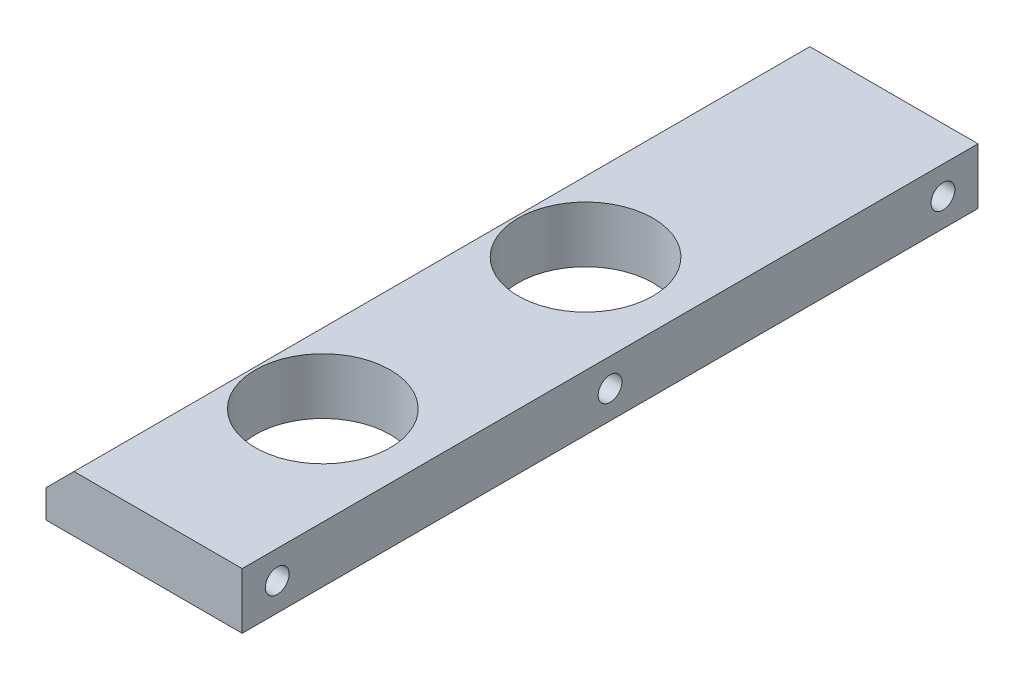
ISO-10303-21;
HEADER;
FILE_DESCRIPTION(('STEP AP214'),'2;1');
FILE_NAME('part.step','',(''),(''),'','','');
FILE_SCHEMA(('AUTOMOTIVE_DESIGN { 1 0 10303 214 1 1 1 1 }'));
ENDSEC;
DATA;
#1=APPLICATION_CONTEXT('core data for automotive mechanical design processes');
#2=APPLICATION_PROTOCOL_DEFINITION('international standard','automotive_design',2000,#1);
#3=PRODUCT_CONTEXT('',#1,'mechanical');
#4=PRODUCT('Part','Part','',(#3));
#5=PRODUCT_RELATED_PRODUCT_CATEGORY('part','',(#4));
#6=PRODUCT_DEFINITION_FORMATION('','',#4);
#7=PRODUCT_DEFINITION_CONTEXT('part definition',#1,'design');
#8=PRODUCT_DEFINITION('design','',#6,#7);
#9=PRODUCT_DEFINITION_SHAPE('','',#8);
#10=(LENGTH_UNIT() NAMED_UNIT(*) SI_UNIT(.MILLI.,.METRE.));
#11=(NAMED_UNIT(*) PLANE_ANGLE_UNIT() SI_UNIT($,.RADIAN.));
#12=(NAMED_UNIT(*) SI_UNIT($,.STERADIAN.) SOLID_ANGLE_UNIT());
#13=UNCERTAINTY_MEASURE_WITH_UNIT(LENGTH_MEASURE(1.E-05),#10,'distance_accuracy_value','');
#14=(GEOMETRIC_REPRESENTATION_CONTEXT(3) GLOBAL_UNCERTAINTY_ASSIGNED_CONTEXT((#13)) GLOBAL_UNIT_ASSIGNED_CONTEXT((#10,
#11,#12)) REPRESENTATION_CONTEXT('',''));
#15=CARTESIAN_POINT('',(0.,0.,0.));
#16=DIRECTION('',(0.,0.,1.));
#17=DIRECTION('',(1.,0.,0.));
#18=AXIS2_PLACEMENT_3D('',#15,#16,#17);
#19=CARTESIAN_POINT('',(13.0000000000337,8.,-95.));
#20=DIRECTION('',(1.,0.,0.));
#21=DIRECTION('',(0.,1.,0.));
#22=AXIS2_PLACEMENT_3D('',#19,#20,#21);
#23=CONICAL_SURFACE('',#22,3.3999999999719,1.02974425866659);
#24=CARTESIAN_POINT('',(10.9570738953551,7.99999999995293,-95.));
#25=VERTEX_POINT('',#24);
#26=VERTEX_LOOP('',#25);
#27=FACE_BOUND('',#26,.T.);
#28=CARTESIAN_POINT('',(13.,8.,-95.));
#29=DIRECTION('',(1.,0.,0.));
#30=DIRECTION('',(0.,0.,-1.));
#31=AXIS2_PLACEMENT_3D('',#28,#29,#30);
#32=CIRCLE('',#31,3.4);
#33=CARTESIAN_POINT('',(13.,8.,-98.4));
#34=VERTEX_POINT('',#33);
#35=EDGE_CURVE('E92',#34,#34,#32,.T.);
#36=ORIENTED_EDGE('',*,*,#35,.T.);
#37=EDGE_LOOP('',(#36));
#38=FACE_BOUND('',#37,.T.);
#39=ADVANCED_FACE('F16',(#27,#38),#23,.F.);
#40=CARTESIAN_POINT('',(12.9999999998631,8.,0.));
#41=DIRECTION('',(1.,0.,0.));
#42=DIRECTION('',(0.,1.,0.));
#43=AXIS2_PLACEMENT_3D('',#40,#41,#42);
#44=CONICAL_SURFACE('',#43,3.39999999982865,1.02974425858268);
#45=CARTESIAN_POINT('',(10.9570738951561,7.9999999997824,0.));
#46=VERTEX_POINT('',#45);
#47=VERTEX_LOOP('',#46);
#48=FACE_BOUND('',#47,.T.);
#49=CARTESIAN_POINT('',(13.,8.,0.));
#50=DIRECTION('',(1.,0.,0.));
#51=DIRECTION('',(0.,0.,-1.));
#52=AXIS2_PLACEMENT_3D('',#49,#50,#51);
#53=CIRCLE('',#52,3.4);
#54=CARTESIAN_POINT('',(13.,8.,-3.4));
#55=VERTEX_POINT('',#54);
#56=EDGE_CURVE('E94',#55,#55,#53,.T.);
#57=ORIENTED_EDGE('',*,*,#56,.T.);
#58=EDGE_LOOP('',(#57));
#59=FACE_BOUND('',#58,.T.);
#60=ADVANCED_FACE('F89',(#48,#59),#44,.F.);
#61=CARTESIAN_POINT('',(13.0000000000337,8.,95.));
#62=DIRECTION('',(1.,0.,0.));
#63=DIRECTION('',(0.,1.,0.));
#64=AXIS2_PLACEMENT_3D('',#61,#62,#63);
#65=CONICAL_SURFACE('',#64,3.39999999996962,1.02974425866599);
#66=CARTESIAN_POINT('',(10.9570738953266,8.00000000000978,95.));
#67=VERTEX_POINT('',#66);
#68=VERTEX_LOOP('',#67);
#69=FACE_BOUND('',#68,.T.);
#70=CARTESIAN_POINT('',(13.,8.,95.));
#71=DIRECTION('',(1.,0.,0.));
#72=DIRECTION('',(0.,0.,-1.));
#73=AXIS2_PLACEMENT_3D('',#70,#71,#72);
#74=CIRCLE('',#73,3.4);
#75=CARTESIAN_POINT('',(13.,8.,91.6));
#76=VERTEX_POINT('',#75);
#77=EDGE_CURVE('E97',#76,#76,#74,.T.);
#78=ORIENTED_EDGE('',*,*,#77,.T.);
#79=EDGE_LOOP('',(#78));
#80=FACE_BOUND('',#79,.T.);
#81=ADVANCED_FACE('F204',(#69,#80),#65,.F.);
#82=CARTESIAN_POINT('',(10.1049275901,8.,-95.));
#83=DIRECTION('',(1.,0.,0.));
#84=DIRECTION('',(0.,0.,-1.));
#85=AXIS2_PLACEMENT_3D('',#82,#83,#84);
#86=CYLINDRICAL_SURFACE('',#85,3.4);
#87=ORIENTED_EDGE('',*,*,#35,.F.);
#88=EDGE_LOOP('',(#87));
#89=FACE_BOUND('',#88,.T.);
#90=CARTESIAN_POINT('',(28.,8.,-95.));
#91=DIRECTION('',(1.,0.,0.));
#92=DIRECTION('',(0.,0.,-1.));
#93=AXIS2_PLACEMENT_3D('',#90,#91,#92);
#94=CIRCLE('',#93,3.4);
#95=CARTESIAN_POINT('',(28.,8.,-98.4));
#96=VERTEX_POINT('',#95);
#97=EDGE_CURVE('E19',#96,#96,#94,.F.);
#98=ORIENTED_EDGE('',*,*,#97,.F.);
#99=EDGE_LOOP('',(#98));
#100=FACE_BOUND('',#99,.T.);
#101=ADVANCED_FACE('F326',(#89,#100),#86,.F.);
#102=CARTESIAN_POINT('',(10.1049275901,8.,0.));
#103=DIRECTION('',(1.,0.,0.));
#104=DIRECTION('',(0.,0.,-1.));
#105=AXIS2_PLACEMENT_3D('',#102,#103,#104);
#106=CYLINDRICAL_SURFACE('',#105,3.4);
#107=ORIENTED_EDGE('',*,*,#56,.F.);
#108=EDGE_LOOP('',(#107));
#109=FACE_BOUND('',#108,.T.);
#110=CARTESIAN_POINT('',(28.,8.,0.));
#111=DIRECTION('',(1.,0.,0.));
#112=DIRECTION('',(0.,0.,-1.));
#113=AXIS2_PLACEMENT_3D('',#110,#111,#112);
#114=CIRCLE('',#113,3.4);
#115=CARTESIAN_POINT('',(28.,8.,-3.4));
#116=VERTEX_POINT('',#115);
#117=EDGE_CURVE('E127',#116,#116,#114,.F.);
#118=ORIENTED_EDGE('',*,*,#117,.F.);
#119=EDGE_LOOP('',(#118));
#120=FACE_BOUND('',#119,.T.);
#121=ADVANCED_FACE('F210',(#109,#120),#106,.F.);
#122=CARTESIAN_POINT('',(10.1049275901,8.,95.));
#123=DIRECTION('',(1.,0.,0.));
#124=DIRECTION('',(0.,0.,-1.));
#125=AXIS2_PLACEMENT_3D('',#122,#123,#124);
#126=CYLINDRICAL_SURFACE('',#125,3.4);
#127=ORIENTED_EDGE('',*,*,#77,.F.);
#128=EDGE_LOOP('',(#127));
#129=FACE_BOUND('',#128,.T.);
#130=CARTESIAN_POINT('',(28.,8.,95.));
#131=DIRECTION('',(1.,0.,0.));
#132=DIRECTION('',(0.,0.,-1.));
#133=AXIS2_PLACEMENT_3D('',#130,#131,#132);
#134=CIRCLE('',#133,3.4);
#135=CARTESIAN_POINT('',(28.,8.,91.6));
#136=VERTEX_POINT('',#135);
#137=EDGE_CURVE('E124',#136,#136,#134,.F.);
#138=ORIENTED_EDGE('',*,*,#137,.F.);
#139=EDGE_LOOP('',(#138));
#140=FACE_BOUND('',#139,.T.);
#141=ADVANCED_FACE('F206',(#129,#140),#126,.F.);
#142=CARTESIAN_POINT('',(-24.,12.,0.));
#143=DIRECTION('',(-0.707106781186548,0.707106781186548,0.));
#144=DIRECTION('',(-0.707106781186548,-0.707106781186548,0.));
#145=AXIS2_PLACEMENT_3D('',#142,#143,#144);
#146=PLANE('',#145);
#147=DIRECTION('',(0.,0.,1.));
#148=VECTOR('',#147,1.);
#149=CARTESIAN_POINT('',(-28.,8.,-105.));
#150=LINE('',#149,#148);
#151=CARTESIAN_POINT('',(-28.,8.,105.));
#152=VERTEX_POINT('',#151);
#153=CARTESIAN_POINT('',(-28.,8.,-105.));
#154=VERTEX_POINT('',#153);
#155=EDGE_CURVE('E153',#152,#154,#150,.F.);
#156=ORIENTED_EDGE('',*,*,#155,.F.);
#157=DIRECTION('',(-0.707106781186548,-0.707106781186548,0.));
#158=VECTOR('',#157,1.);
#159=CARTESIAN_POINT('',(-20.,16.,105.));
#160=LINE('',#159,#158);
#161=CARTESIAN_POINT('',(-20.,16.,105.));
#162=VERTEX_POINT('',#161);
#163=EDGE_CURVE('E141',#162,#152,#160,.T.);
#164=ORIENTED_EDGE('',*,*,#163,.F.);
#165=DIRECTION('',(0.,0.,1.));
#166=VECTOR('',#165,1.);
#167=CARTESIAN_POINT('',(-20.,16.,0.));
#168=LINE('',#167,#166);
#169=CARTESIAN_POINT('',(-20.,16.,-105.));
#170=VERTEX_POINT('',#169);
#171=EDGE_CURVE('E200',#170,#162,#168,.T.);
#172=ORIENTED_EDGE('',*,*,#171,.F.);
#173=DIRECTION('',(0.707106781186548,0.707106781186548,0.));
#174=VECTOR('',#173,1.);
#175=CARTESIAN_POINT('',(-28.,8.,-105.));
#176=LINE('',#175,#174);
#177=EDGE_CURVE('E123',#154,#170,#176,.T.);
#178=ORIENTED_EDGE('',*,*,#177,.F.);
#179=EDGE_LOOP('',(#156,#164,#172,#178));
#180=FACE_BOUND('',#179,.T.);
#181=ADVANCED_FACE('F209',(#180),#146,.T.);
#182=CARTESIAN_POINT('',(0.,16.,0.));
#183=DIRECTION('',(0.,1.,0.));
#184=DIRECTION('',(0.,0.,1.));
#185=AXIS2_PLACEMENT_3D('',#182,#183,#184);
#186=PLANE('',#185);
#187=CARTESIAN_POINT('',(0.,16.,-21.));
#188=DIRECTION('',(0.,-1.,0.));
#189=DIRECTION('',(0.,0.,-1.));
#190=AXIS2_PLACEMENT_3D('',#187,#188,#189);
#191=CIRCLE('',#190,19.25);
#192=CARTESIAN_POINT('',(0.,16.,-40.25));
#193=VERTEX_POINT('',#192);
#194=EDGE_CURVE('E116',#193,#193,#191,.T.);
#195=ORIENTED_EDGE('',*,*,#194,.T.);
#196=EDGE_LOOP('',(#195));
#197=FACE_BOUND('',#196,.T.);
#198=CARTESIAN_POINT('',(0.,16.,54.));
#199=DIRECTION('',(0.,-1.,0.));
#200=DIRECTION('',(0.,0.,-1.));
#201=AXIS2_PLACEMENT_3D('',#198,#199,#200);
#202=CIRCLE('',#201,19.25);
#203=CARTESIAN_POINT('',(0.,16.,34.75));
#204=VERTEX_POINT('',#203);
#205=EDGE_CURVE('E120',#204,#204,#202,.T.);
#206=ORIENTED_EDGE('',*,*,#205,.T.);
#207=EDGE_LOOP('',(#206));
#208=FACE_BOUND('',#207,.T.);
#209=DIRECTION('',(-1.,0.,0.));
#210=VECTOR('',#209,1.);
#211=CARTESIAN_POINT('',(28.,16.,-105.));
#212=LINE('',#211,#210);
#213=CARTESIAN_POINT('',(28.,16.,-105.));
#214=VERTEX_POINT('',#213);
#215=EDGE_CURVE('E126',#170,#214,#212,.F.);
#216=ORIENTED_EDGE('',*,*,#215,.F.);
#217=ORIENTED_EDGE('',*,*,#171,.T.);
#218=DIRECTION('',(1.,0.,0.));
#219=VECTOR('',#218,1.);
#220=CARTESIAN_POINT('',(-28.,16.,105.));
#221=LINE('',#220,#219);
#222=CARTESIAN_POINT('',(28.,16.,105.));
#223=VERTEX_POINT('',#222);
#224=EDGE_CURVE('E148',#223,#162,#221,.F.);
#225=ORIENTED_EDGE('',*,*,#224,.F.);
#226=DIRECTION('',(0.,0.,-1.));
#227=VECTOR('',#226,1.);
#228=CARTESIAN_POINT('',(28.,16.,105.));
#229=LINE('',#228,#227);
#230=EDGE_CURVE('E135',#214,#223,#229,.F.);
#231=ORIENTED_EDGE('',*,*,#230,.F.);
#232=EDGE_LOOP('',(#216,#217,#225,#231));
#233=FACE_BOUND('',#232,.T.);
#234=ADVANCED_FACE('F285',(#197,#208,#233),#186,.T.);
#235=CARTESIAN_POINT('',(-14.3,11.0000000000241,78.7));
#236=DIRECTION('',(0.,-1.,0.));
#237=DIRECTION('',(0.,0.,-1.));
#238=AXIS2_PLACEMENT_3D('',#235,#236,#237);
#239=CONICAL_SURFACE('',#238,2.49999999997154,1.02974425866932);
#240=CARTESIAN_POINT('',(-14.3,11.,78.7));
#241=DIRECTION('',(0.,-1.,0.));
#242=DIRECTION('',(0.,0.,-1.));
#243=AXIS2_PLACEMENT_3D('',#240,#241,#242);
#244=CIRCLE('',#243,2.5);
#245=CARTESIAN_POINT('',(-14.3,11.,76.2));
#246=VERTEX_POINT('',#245);
#247=EDGE_CURVE('E119',#246,#246,#244,.T.);
#248=ORIENTED_EDGE('',*,*,#247,.T.);
#249=EDGE_LOOP('',(#248));
#250=FACE_BOUND('',#249,.T.);
#251=CARTESIAN_POINT('',(-14.3000000000768,12.5021515475225,78.7));
#252=VERTEX_POINT('',#251);
#253=VERTEX_LOOP('',#252);
#254=FACE_BOUND('',#253,.T.);
#255=ADVANCED_FACE('F314',(#250,#254),#239,.F.);
#256=CARTESIAN_POINT('',(14.3,10.9999999999673,29.3));
#257=DIRECTION('',(0.,-1.,0.));
#258=DIRECTION('',(0.,0.,-1.));
#259=AXIS2_PLACEMENT_3D('',#256,#257,#258);
#260=CONICAL_SURFACE('',#259,2.50000000001983,1.02974425867857);
#261=CARTESIAN_POINT('',(14.3,11.,29.3));
#262=DIRECTION('',(0.,-1.,0.));
#263=DIRECTION('',(0.,0.,-1.));
#264=AXIS2_PLACEMENT_3D('',#261,#262,#263);
#265=CIRCLE('',#264,2.5);
#266=CARTESIAN_POINT('',(14.3,11.,26.8));
#267=VERTEX_POINT('',#266);
#268=EDGE_CURVE('E195',#267,#267,#265,.T.);
#269=ORIENTED_EDGE('',*,*,#268,.T.);
#270=EDGE_LOOP('',(#269));
#271=FACE_BOUND('',#270,.T.);
#272=CARTESIAN_POINT('',(14.30000000002,12.502151547551,29.3));
#273=VERTEX_POINT('',#272);
#274=VERTEX_LOOP('',#273);
#275=FACE_BOUND('',#274,.T.);
#276=ADVANCED_FACE('F308',(#271,#275),#260,.F.);
#277=CARTESIAN_POINT('',(14.3,11.0000000000809,-45.7));
#278=DIRECTION('',(0.,-1.,0.));
#279=DIRECTION('',(0.,0.,-1.));
#280=AXIS2_PLACEMENT_3D('',#277,#278,#279);
#281=CONICAL_SURFACE('',#280,2.49999999978108,1.02974425852182);
#282=CARTESIAN_POINT('',(14.3,11.,-45.7));
#283=DIRECTION('',(0.,-1.,0.));
#284=DIRECTION('',(0.,0.,-1.));
#285=AXIS2_PLACEMENT_3D('',#282,#283,#284);
#286=CIRCLE('',#285,2.5);
#287=CARTESIAN_POINT('',(14.3,11.,-48.2));
#288=VERTEX_POINT('',#287);
#289=EDGE_CURVE('E160',#288,#288,#286,.T.);
#290=ORIENTED_EDGE('',*,*,#289,.T.);
#291=EDGE_LOOP('',(#290));
#292=FACE_BOUND('',#291,.T.);
#293=CARTESIAN_POINT('',(14.2999999997357,12.5021515476362,-45.7));
#294=VERTEX_POINT('',#293);
#295=VERTEX_LOOP('',#294);
#296=FACE_BOUND('',#295,.T.);
#297=ADVANCED_FACE('F299',(#292,#296),#281,.F.);
#298=CARTESIAN_POINT('',(-14.3,11.0000000000809,3.69999999999999));
#299=DIRECTION('',(0.,-1.,0.));
#300=DIRECTION('',(0.,0.,-1.));
#301=AXIS2_PLACEMENT_3D('',#298,#299,#300);
#302=CONICAL_SURFACE('',#301,2.50000000003529,1.02974425868861);
#303=CARTESIAN_POINT('',(-11.799999999983,11.0000000000241,3.69999999999999));
#304=CARTESIAN_POINT('',(-11.9041666666658,11.0625896478075,3.69999999999947));
#305=CARTESIAN_POINT('',(-12.0083333333299,11.1251792956221,3.69999999999901));
#306=CARTESIAN_POINT('',(-12.2166666666581,11.2503585912702,3.69999999999822));
#307=CARTESIAN_POINT('',(-12.3208333333221,11.3129482391038,3.69999999999789));
#308=CARTESIAN_POINT('',(-12.5291666666627,11.4381275347313,3.69999999999736));
#309=CARTESIAN_POINT('',(-12.6333333333392,11.5007171825252,3.69999999999716));
#310=CARTESIAN_POINT('',(-12.841666666676,11.625896478159,3.6999999999969));
#311=CARTESIAN_POINT('',(-12.9458333333363,11.6884861259988,3.69999999999683));
#312=CARTESIAN_POINT('',(-13.1541666666759,11.813665421628,3.69999999999683));
#313=CARTESIAN_POINT('',(-13.2583333333551,11.8762550694174,3.6999999999969));
#314=CARTESIAN_POINT('',(-13.4666666666735,12.0014343650503,3.69999999999716));
#315=CARTESIAN_POINT('',(-13.5708333333126,12.0640240128939,3.69999999999736));
#316=CARTESIAN_POINT('',(-13.7791666666271,12.1892033085332,3.69999999999789));
#317=CARTESIAN_POINT('',(-13.8833333333026,12.2517929563288,3.69999999999822));
#318=CARTESIAN_POINT('',(-14.0916666666535,12.3769722519391,3.69999999999901));
#319=CARTESIAN_POINT('',(-14.195833333329,12.4395618997536,3.69999999999947));
#320=CARTESIAN_POINT('',(-14.2999999999807,12.5021515476078,3.69999999999999));
#321=B_SPLINE_CURVE_WITH_KNOTS('',3,(#303,#304,#305,#306,#307,#308,#309,#310,#311,#312,#313,
#314,#315,#316,#317,#318,#319,#320),.UNSPECIFIED.,.F.,.F.,(4,2,2,2,2,2,2,2,4),(0.,
0.364572936621953,0.729145873273182,1.09371880989513,1.45829174654636,1.82286468316832,
2.18743761977082,2.55201055639277,2.916583493044),.UNSPECIFIED.);
#322=CARTESIAN_POINT('',(-11.7999999999958,11.000000000006,3.69999999999999));
#323=VERTEX_POINT('',#322);
#324=CARTESIAN_POINT('',(-14.3,12.5021515476078,3.69999999999999));
#325=VERTEX_POINT('',#324);
#326=EDGE_CURVE('E155',#323,#325,#321,.T.);
#327=ORIENTED_EDGE('',*,*,#326,.T.);
#328=CARTESIAN_POINT('',(-14.3000000000193,12.5021515476078,3.69999999999999));
#329=CARTESIAN_POINT('',(-14.4041666666709,12.4395618997536,3.69999999999947));
#330=CARTESIAN_POINT('',(-14.5083333333464,12.3769722519391,3.69999999999901));
#331=CARTESIAN_POINT('',(-14.7166666666974,12.2517929563288,3.69999999999822));
#332=CARTESIAN_POINT('',(-14.8208333333728,12.1892033085332,3.69999999999789));
#333=CARTESIAN_POINT('',(-15.0291666666874,12.0640240128939,3.69999999999736));
#334=CARTESIAN_POINT('',(-15.1333333333265,12.0014343650503,3.69999999999716));
#335=CARTESIAN_POINT('',(-15.3416666666448,11.8762550694174,3.6999999999969));
#336=CARTESIAN_POINT('',(-15.4458333333241,11.813665421628,3.69999999999683));
#337=CARTESIAN_POINT('',(-15.6541666666637,11.6884861259988,3.69999999999683));
#338=CARTESIAN_POINT('',(-15.7583333333239,11.625896478159,3.6999999999969));
#339=CARTESIAN_POINT('',(-15.9666666666607,11.5007171825252,3.69999999999716));
#340=CARTESIAN_POINT('',(-16.0708333333372,11.4381275347313,3.69999999999736));
#341=CARTESIAN_POINT('',(-16.2791666666778,11.3129482391038,3.69999999999789));
#342=CARTESIAN_POINT('',(-16.3833333333419,11.2503585912702,3.69999999999822));
#343=CARTESIAN_POINT('',(-16.5916666666701,11.1251792956221,3.69999999999901));
#344=CARTESIAN_POINT('',(-16.6958333333341,11.0625896478075,3.69999999999947));
#345=CARTESIAN_POINT('',(-16.800000000017,11.0000000000241,3.7));
#346=B_SPLINE_CURVE_WITH_KNOTS('',3,(#328,#329,#330,#331,#332,#333,#334,#335,#336,#337,#338,
#339,#340,#341,#342,#343,#344,#345),.UNSPECIFIED.,.F.,.F.,(4,2,2,2,2,2,2,2,4),(0.,
0.364572936651229,0.729145873273182,1.09371880987569,1.45829174649764,1.82286468314887,
2.18743761977082,2.55201055642205,2.916583493044),.UNSPECIFIED.);
#347=CARTESIAN_POINT('',(-16.8000000000043,11.000000000006,3.69999999999999));
#348=VERTEX_POINT('',#347);
#349=EDGE_CURVE('E170',#325,#348,#346,.T.);
#350=ORIENTED_EDGE('',*,*,#349,.T.);
#351=CARTESIAN_POINT('',(-14.3,11.,3.69999999999999));
#352=DIRECTION('',(0.,-1.,0.));
#353=DIRECTION('',(0.,0.,-1.));
#354=AXIS2_PLACEMENT_3D('',#351,#352,#353);
#355=CIRCLE('',#354,2.5);
#356=EDGE_CURVE('E156',#348,#323,#355,.T.);
#357=ORIENTED_EDGE('',*,*,#356,.T.);
#358=EDGE_LOOP('',(#327,#350,#357));
#359=FACE_BOUND('',#358,.T.);
#360=ADVANCED_FACE('F294',(#359),#302,.F.);
#361=CARTESIAN_POINT('',(-14.3,11.0000000000241,3.69999999999999));
#362=DIRECTION('',(0.,-1.,0.));
#363=DIRECTION('',(0.,0.,-1.));
#364=AXIS2_PLACEMENT_3D('',#361,#362,#363);
#365=CONICAL_SURFACE('',#364,2.50000000001701,1.0297442586719);
#366=CARTESIAN_POINT('',(-14.3,11.,3.69999999999999));
#367=DIRECTION('',(0.,-1.,0.));
#368=DIRECTION('',(0.,0.,-1.));
#369=AXIS2_PLACEMENT_3D('',#366,#367,#368);
#370=CIRCLE('',#369,2.5);
#371=EDGE_CURVE('E159',#323,#348,#370,.T.);
#372=ORIENTED_EDGE('',*,*,#371,.T.);
#373=ORIENTED_EDGE('',*,*,#349,.F.);
#374=ORIENTED_EDGE('',*,*,#326,.F.);
#375=EDGE_LOOP('',(#372,#373,#374));
#376=FACE_BOUND('',#375,.T.);
#377=ADVANCED_FACE('F178',(#376),#365,.F.);
#378=CARTESIAN_POINT('',(-28.,0.,-105.));
#379=DIRECTION('',(-1.,0.,0.));
#380=DIRECTION('',(0.,0.,1.));
#381=AXIS2_PLACEMENT_3D('',#378,#379,#380);
#382=PLANE('',#381);
#383=DIRECTION('',(0.,1.,0.));
#384=VECTOR('',#383,1.);
#385=CARTESIAN_POINT('',(-28.,0.,105.));
#386=LINE('',#385,#384);
#387=CARTESIAN_POINT('',(-28.,0.,105.));
#388=VERTEX_POINT('',#387);
#389=EDGE_CURVE('E151',#152,#388,#386,.F.);
#390=ORIENTED_EDGE('',*,*,#389,.F.);
#391=ORIENTED_EDGE('',*,*,#155,.T.);
#392=DIRECTION('',(0.,1.,0.));
#393=VECTOR('',#392,1.);
#394=CARTESIAN_POINT('',(-28.,0.,-105.));
#395=LINE('',#394,#393);
#396=CARTESIAN_POINT('',(-28.,0.,-105.));
#397=VERTEX_POINT('',#396);
#398=EDGE_CURVE('E278',#397,#154,#395,.T.);
#399=ORIENTED_EDGE('',*,*,#398,.F.);
#400=DIRECTION('',(0.,0.,1.));
#401=VECTOR('',#400,1.);
#402=CARTESIAN_POINT('',(-28.,0.,0.));
#403=LINE('',#402,#401);
#404=EDGE_CURVE('E165',#397,#388,#403,.T.);
#405=ORIENTED_EDGE('',*,*,#404,.T.);
#406=EDGE_LOOP('',(#390,#391,#399,#405));
#407=FACE_BOUND('',#406,.T.);
#408=ADVANCED_FACE('F176',(#407),#382,.T.);
#409=CARTESIAN_POINT('',(-28.,0.,105.));
#410=DIRECTION('',(0.,0.,1.));
#411=DIRECTION('',(1.,0.,0.));
#412=AXIS2_PLACEMENT_3D('',#409,#410,#411);
#413=PLANE('',#412);
#414=ORIENTED_EDGE('',*,*,#224,.T.);
#415=ORIENTED_EDGE('',*,*,#163,.T.);
#416=ORIENTED_EDGE('',*,*,#389,.T.);
#417=DIRECTION('',(1.,0.,0.));
#418=VECTOR('',#417,1.);
#419=CARTESIAN_POINT('',(0.,0.,105.));
#420=LINE('',#419,#418);
#421=CARTESIAN_POINT('',(28.,0.,105.));
#422=VERTEX_POINT('',#421);
#423=EDGE_CURVE('E268',#388,#422,#420,.T.);
#424=ORIENTED_EDGE('',*,*,#423,.T.);
#425=DIRECTION('',(0.,1.,0.));
#426=VECTOR('',#425,1.);
#427=CARTESIAN_POINT('',(28.,0.,105.));
#428=LINE('',#427,#426);
#429=EDGE_CURVE('E132',#223,#422,#428,.F.);
#430=ORIENTED_EDGE('',*,*,#429,.F.);
#431=EDGE_LOOP('',(#414,#415,#416,#424,#430));
#432=FACE_BOUND('',#431,.T.);
#433=ADVANCED_FACE('F217',(#432),#413,.T.);
#434=CARTESIAN_POINT('',(28.,0.,105.));
#435=DIRECTION('',(1.,0.,0.));
#436=DIRECTION('',(0.,0.,-1.));
#437=AXIS2_PLACEMENT_3D('',#434,#435,#436);
#438=PLANE('',#437);
#439=ORIENTED_EDGE('',*,*,#137,.T.);
#440=EDGE_LOOP('',(#439));
#441=FACE_BOUND('',#440,.T.);
#442=ORIENTED_EDGE('',*,*,#117,.T.);
#443=EDGE_LOOP('',(#442));
#444=FACE_BOUND('',#443,.T.);
#445=ORIENTED_EDGE('',*,*,#97,.T.);
#446=EDGE_LOOP('',(#445));
#447=FACE_BOUND('',#446,.T.);
#448=ORIENTED_EDGE('',*,*,#429,.T.);
#449=DIRECTION('',(0.,0.,1.));
#450=VECTOR('',#449,1.);
#451=CARTESIAN_POINT('',(28.,0.,0.));
#452=LINE('',#451,#450);
#453=CARTESIAN_POINT('',(28.,0.,-105.));
#454=VERTEX_POINT('',#453);
#455=EDGE_CURVE('E266',#422,#454,#452,.F.);
#456=ORIENTED_EDGE('',*,*,#455,.T.);
#457=DIRECTION('',(0.,1.,0.));
#458=VECTOR('',#457,1.);
#459=CARTESIAN_POINT('',(28.,0.,-105.));
#460=LINE('',#459,#458);
#461=EDGE_CURVE('E34',#214,#454,#460,.F.);
#462=ORIENTED_EDGE('',*,*,#461,.F.);
#463=ORIENTED_EDGE('',*,*,#230,.T.);
#464=EDGE_LOOP('',(#448,#456,#462,#463));
#465=FACE_BOUND('',#464,.T.);
#466=ADVANCED_FACE('F214',(#441,#444,#447,#465),#438,.T.);
#467=CARTESIAN_POINT('',(28.,0.,-105.));
#468=DIRECTION('',(0.,0.,-1.));
#469=DIRECTION('',(-1.,0.,0.));
#470=AXIS2_PLACEMENT_3D('',#467,#468,#469);
#471=PLANE('',#470);
#472=ORIENTED_EDGE('',*,*,#398,.T.);
#473=ORIENTED_EDGE('',*,*,#177,.T.);
#474=ORIENTED_EDGE('',*,*,#215,.T.);
#475=ORIENTED_EDGE('',*,*,#461,.T.);
#476=DIRECTION('',(1.,0.,0.));
#477=VECTOR('',#476,1.);
#478=CARTESIAN_POINT('',(0.,0.,-105.));
#479=LINE('',#478,#477);
#480=EDGE_CURVE('E115',#454,#397,#479,.F.);
#481=ORIENTED_EDGE('',*,*,#480,.T.);
#482=EDGE_LOOP('',(#472,#473,#474,#475,#481));
#483=FACE_BOUND('',#482,.T.);
#484=ADVANCED_FACE('F216',(#483),#471,.T.);
#485=CARTESIAN_POINT('',(0.,16.,54.));
#486=DIRECTION('',(0.,-1.,0.));
#487=DIRECTION('',(0.,0.,-1.));
#488=AXIS2_PLACEMENT_3D('',#485,#486,#487);
#489=CYLINDRICAL_SURFACE('',#488,19.25);
#490=ORIENTED_EDGE('',*,*,#205,.F.);
#491=EDGE_LOOP('',(#490));
#492=FACE_BOUND('',#491,.T.);
#493=CARTESIAN_POINT('',(0.,0.,54.));
#494=DIRECTION('',(0.,-1.,0.));
#495=DIRECTION('',(0.,0.,-1.));
#496=AXIS2_PLACEMENT_3D('',#493,#494,#495);
#497=CIRCLE('',#496,19.25);
#498=CARTESIAN_POINT('',(0.,0.,34.75));
#499=VERTEX_POINT('',#498);
#500=EDGE_CURVE('E112',#499,#499,#497,.T.);
#501=ORIENTED_EDGE('',*,*,#500,.T.);
#502=EDGE_LOOP('',(#501));
#503=FACE_BOUND('',#502,.T.);
#504=ADVANCED_FACE('F224',(#492,#503),#489,.F.);
#505=CARTESIAN_POINT('',(0.,16.,-21.));
#506=DIRECTION('',(0.,-1.,0.));
#507=DIRECTION('',(0.,0.,-1.));
#508=AXIS2_PLACEMENT_3D('',#505,#506,#507);
#509=CYLINDRICAL_SURFACE('',#508,19.25);
#510=ORIENTED_EDGE('',*,*,#194,.F.);
#511=EDGE_LOOP('',(#510));
#512=FACE_BOUND('',#511,.T.);
#513=CARTESIAN_POINT('',(0.,0.,-21.));
#514=DIRECTION('',(0.,-1.,0.));
#515=DIRECTION('',(0.,0.,-1.));
#516=AXIS2_PLACEMENT_3D('',#513,#514,#515);
#517=CIRCLE('',#516,19.25);
#518=CARTESIAN_POINT('',(0.,0.,-40.25));
#519=VERTEX_POINT('',#518);
#520=EDGE_CURVE('E109',#519,#519,#517,.T.);
#521=ORIENTED_EDGE('',*,*,#520,.T.);
#522=EDGE_LOOP('',(#521));
#523=FACE_BOUND('',#522,.T.);
#524=ADVANCED_FACE('F251',(#512,#523),#509,.F.);
#525=CARTESIAN_POINT('',(-14.3,13.1272591249,78.7));
#526=DIRECTION('',(0.,-1.,0.));
#527=DIRECTION('',(0.,0.,-1.));
#528=AXIS2_PLACEMENT_3D('',#525,#526,#527);
#529=CYLINDRICAL_SURFACE('',#528,2.5);
#530=ORIENTED_EDGE('',*,*,#247,.F.);
#531=EDGE_LOOP('',(#530));
#532=FACE_BOUND('',#531,.T.);
#533=CARTESIAN_POINT('',(-14.3,0.,78.7));
#534=DIRECTION('',(0.,-1.,0.));
#535=DIRECTION('',(0.,0.,-1.));
#536=AXIS2_PLACEMENT_3D('',#533,#534,#535);
#537=CIRCLE('',#536,2.5);
#538=CARTESIAN_POINT('',(-14.3,0.,76.2));
#539=VERTEX_POINT('',#538);
#540=EDGE_CURVE('E106',#539,#539,#537,.T.);
#541=ORIENTED_EDGE('',*,*,#540,.T.);
#542=EDGE_LOOP('',(#541));
#543=FACE_BOUND('',#542,.T.);
#544=ADVANCED_FACE('F247',(#532,#543),#529,.F.);
#545=CARTESIAN_POINT('',(14.3,13.1272591249,29.3));
#546=DIRECTION('',(0.,-1.,0.));
#547=DIRECTION('',(0.,0.,-1.));
#548=AXIS2_PLACEMENT_3D('',#545,#546,#547);
#549=CYLINDRICAL_SURFACE('',#548,2.5);
#550=ORIENTED_EDGE('',*,*,#268,.F.);
#551=EDGE_LOOP('',(#550));
#552=FACE_BOUND('',#551,.T.);
#553=CARTESIAN_POINT('',(14.3,0.,29.3));
#554=DIRECTION('',(0.,-1.,0.));
#555=DIRECTION('',(0.,0.,-1.));
#556=AXIS2_PLACEMENT_3D('',#553,#554,#555);
#557=CIRCLE('',#556,2.5);
#558=CARTESIAN_POINT('',(14.3,0.,26.8));
#559=VERTEX_POINT('',#558);
#560=EDGE_CURVE('E103',#559,#559,#557,.T.);
#561=ORIENTED_EDGE('',*,*,#560,.T.);
#562=EDGE_LOOP('',(#561));
#563=FACE_BOUND('',#562,.T.);
#564=ADVANCED_FACE('F243',(#552,#563),#549,.F.);
#565=CARTESIAN_POINT('',(14.3,13.1272591249,-45.7));
#566=DIRECTION('',(0.,-1.,0.));
#567=DIRECTION('',(0.,0.,-1.));
#568=AXIS2_PLACEMENT_3D('',#565,#566,#567);
#569=CYLINDRICAL_SURFACE('',#568,2.5);
#570=ORIENTED_EDGE('',*,*,#289,.F.);
#571=EDGE_LOOP('',(#570));
#572=FACE_BOUND('',#571,.T.);
#573=CARTESIAN_POINT('',(14.3,0.,-45.7));
#574=DIRECTION('',(0.,-1.,0.));
#575=DIRECTION('',(0.,0.,-1.));
#576=AXIS2_PLACEMENT_3D('',#573,#574,#575);
#577=CIRCLE('',#576,2.5);
#578=CARTESIAN_POINT('',(14.3,0.,-48.2));
#579=VERTEX_POINT('',#578);
#580=EDGE_CURVE('E25',#579,#579,#577,.T.);
#581=ORIENTED_EDGE('',*,*,#580,.T.);
#582=EDGE_LOOP('',(#581));
#583=FACE_BOUND('',#582,.T.);
#584=ADVANCED_FACE('F235',(#572,#583),#569,.F.);
#585=CARTESIAN_POINT('',(-14.3,13.1272591249,3.69999999999999));
#586=DIRECTION('',(0.,-1.,0.));
#587=DIRECTION('',(0.,0.,-1.));
#588=AXIS2_PLACEMENT_3D('',#585,#586,#587);
#589=CYLINDRICAL_SURFACE('',#588,2.5);
#590=ORIENTED_EDGE('',*,*,#371,.F.);
#591=ORIENTED_EDGE('',*,*,#356,.F.);
#592=EDGE_LOOP('',(#590,#591));
#593=FACE_BOUND('',#592,.T.);
#594=CARTESIAN_POINT('',(-14.3,0.,3.69999999999999));
#595=DIRECTION('',(0.,-1.,0.));
#596=DIRECTION('',(0.,0.,-1.));
#597=AXIS2_PLACEMENT_3D('',#594,#595,#596);
#598=CIRCLE('',#597,2.5);
#599=CARTESIAN_POINT('',(-14.3,0.,1.19999999999999));
#600=VERTEX_POINT('',#599);
#601=EDGE_CURVE('E11',#600,#600,#598,.T.);
#602=ORIENTED_EDGE('',*,*,#601,.T.);
#603=EDGE_LOOP('',(#602));
#604=FACE_BOUND('',#603,.T.);
#605=ADVANCED_FACE('F229',(#593,#604),#589,.F.);
#606=CARTESIAN_POINT('',(0.,0.,0.));
#607=DIRECTION('',(0.,1.,0.));
#608=DIRECTION('',(0.,0.,1.));
#609=AXIS2_PLACEMENT_3D('',#606,#607,#608);
#610=PLANE('',#609);
#611=ORIENTED_EDGE('',*,*,#601,.F.);
#612=EDGE_LOOP('',(#611));
#613=FACE_BOUND('',#612,.T.);
#614=ORIENTED_EDGE('',*,*,#580,.F.);
#615=EDGE_LOOP('',(#614));
#616=FACE_BOUND('',#615,.T.);
#617=ORIENTED_EDGE('',*,*,#560,.F.);
#618=EDGE_LOOP('',(#617));
#619=FACE_BOUND('',#618,.T.);
#620=ORIENTED_EDGE('',*,*,#540,.F.);
#621=EDGE_LOOP('',(#620));
#622=FACE_BOUND('',#621,.T.);
#623=ORIENTED_EDGE('',*,*,#520,.F.);
#624=EDGE_LOOP('',(#623));
#625=FACE_BOUND('',#624,.T.);
#626=ORIENTED_EDGE('',*,*,#500,.F.);
#627=EDGE_LOOP('',(#626));
#628=FACE_BOUND('',#627,.T.);
#629=ORIENTED_EDGE('',*,*,#455,.F.);
#630=ORIENTED_EDGE('',*,*,#423,.F.);
#631=ORIENTED_EDGE('',*,*,#404,.F.);
#632=ORIENTED_EDGE('',*,*,#480,.F.);
#633=EDGE_LOOP('',(#629,#630,#631,#632));
#634=FACE_BOUND('',#633,.T.);
#635=ADVANCED_FACE('F227',(#613,#616,#619,#622,#625,#628,#634),#610,.F.);
#636=CLOSED_SHELL('',(#39,#60,#81,#101,#121,#141,#181,#234,#255,#276,#297,#360,#377,#408,#433,
#466,#484,#504,#524,#544,#564,#584,#605,#635));
#637=MANIFOLD_SOLID_BREP('B1',#636);
#638=ADVANCED_BREP_SHAPE_REPRESENTATION('',(#18,#637),#14);
#639=SHAPE_DEFINITION_REPRESENTATION(#9,#638);
ENDSEC;
END-ISO-10303-21;
